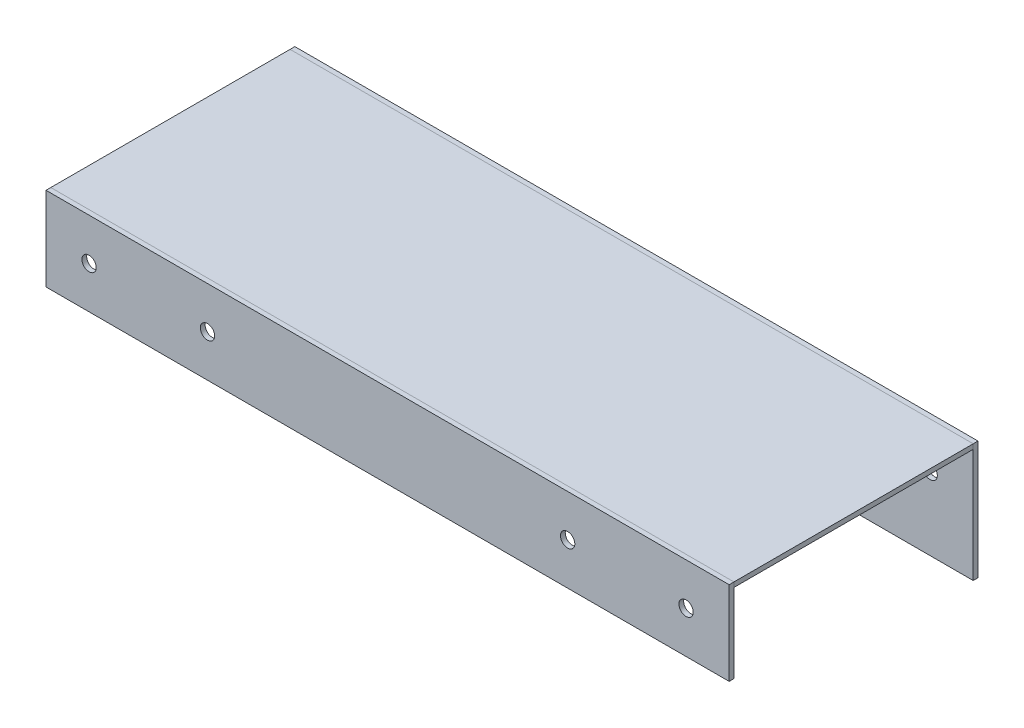
ISO-10303-21;
HEADER;
FILE_DESCRIPTION(('STEP AP214'),'2;1');
FILE_NAME('part.step','',(''),(''),'','','');
FILE_SCHEMA(('AUTOMOTIVE_DESIGN { 1 0 10303 214 1 1 1 1 }'));
ENDSEC;
DATA;
#1=APPLICATION_CONTEXT('core data for automotive mechanical design processes');
#2=APPLICATION_PROTOCOL_DEFINITION('international standard','automotive_design',2000,#1);
#3=PRODUCT_CONTEXT('',#1,'mechanical');
#4=PRODUCT('Part','Part','',(#3));
#5=PRODUCT_RELATED_PRODUCT_CATEGORY('part','',(#4));
#6=PRODUCT_DEFINITION_FORMATION('','',#4);
#7=PRODUCT_DEFINITION_CONTEXT('part definition',#1,'design');
#8=PRODUCT_DEFINITION('design','',#6,#7);
#9=PRODUCT_DEFINITION_SHAPE('','',#8);
#10=(LENGTH_UNIT() NAMED_UNIT(*) SI_UNIT(.MILLI.,.METRE.));
#11=(NAMED_UNIT(*) PLANE_ANGLE_UNIT() SI_UNIT($,.RADIAN.));
#12=(NAMED_UNIT(*) SI_UNIT($,.STERADIAN.) SOLID_ANGLE_UNIT());
#13=UNCERTAINTY_MEASURE_WITH_UNIT(LENGTH_MEASURE(1.E-05),#10,'distance_accuracy_value','');
#14=(GEOMETRIC_REPRESENTATION_CONTEXT(3) GLOBAL_UNCERTAINTY_ASSIGNED_CONTEXT((#13)) GLOBAL_UNIT_ASSIGNED_CONTEXT((#10,
#11,#12)) REPRESENTATION_CONTEXT('',''));
#15=CARTESIAN_POINT('',(0.,0.,0.));
#16=DIRECTION('',(0.,0.,1.));
#17=DIRECTION('',(1.,0.,0.));
#18=AXIS2_PLACEMENT_3D('',#15,#16,#17);
#19=CARTESIAN_POINT('',(-37.505803891122,45.7813109581088,113.428482269106));
#20=DIRECTION('',(0.,0.,1.));
#21=DIRECTION('',(1.,0.,0.));
#22=AXIS2_PLACEMENT_3D('',#19,#20,#21);
#23=PLANE('',#22);
#24=CARTESIAN_POINT('',(37.7441961088779,45.7813109581088,113.428482269106));
#25=DIRECTION('',(0.,0.,1.));
#26=DIRECTION('',(-1.,0.,0.));
#27=AXIS2_PLACEMENT_3D('',#24,#25,#26);
#28=CIRCLE('',#27,3.00000000000001);
#29=CARTESIAN_POINT('',(34.7441961088779,45.7813109581088,113.428482269106));
#30=VERTEX_POINT('',#29);
#31=EDGE_CURVE('P0_E104',#30,#30,#28,.T.);
#32=ORIENTED_EDGE('',*,*,#31,.F.);
#33=EDGE_LOOP('',(#32));
#34=FACE_BOUND('',#33,.T.);
#35=CARTESIAN_POINT('',(-162.255803891122,45.7813109581088,113.428482269106));
#36=DIRECTION('',(0.,0.,1.));
#37=DIRECTION('',(1.,0.,0.));
#38=AXIS2_PLACEMENT_3D('',#35,#36,#37);
#39=CIRCLE('',#38,3.00000000000001);
#40=CARTESIAN_POINT('',(-159.255803891122,45.7813109581088,113.428482269106));
#41=VERTEX_POINT('',#40);
#42=EDGE_CURVE('P0_E83',#41,#41,#39,.T.);
#43=ORIENTED_EDGE('',*,*,#42,.F.);
#44=EDGE_LOOP('',(#43));
#45=FACE_BOUND('',#44,.T.);
#46=DIRECTION('',(0.,1.,0.));
#47=VECTOR('',#46,1.);
#48=CARTESIAN_POINT('',(105.244196108878,63.2813109581088,113.428482269106));
#49=LINE('',#48,#47);
#50=CARTESIAN_POINT('',(105.244196108878,28.2813109581088,113.428482269106));
#51=VERTEX_POINT('',#50);
#52=CARTESIAN_POINT('',(105.244196108878,63.2813109581088,113.428482269106));
#53=VERTEX_POINT('',#52);
#54=EDGE_CURVE('P0_E68',#51,#53,#49,.T.);
#55=ORIENTED_EDGE('',*,*,#54,.T.);
#56=DIRECTION('',(-1.,0.,0.));
#57=VECTOR('',#56,1.);
#58=CARTESIAN_POINT('',(-180.255803891122,63.2813109581088,113.428482269106));
#59=LINE('',#58,#57);
#60=CARTESIAN_POINT('',(-180.255803891122,63.2813109581088,113.428482269106));
#61=VERTEX_POINT('',#60);
#62=EDGE_CURVE('P0_E63',#53,#61,#59,.T.);
#63=ORIENTED_EDGE('',*,*,#62,.T.);
#64=DIRECTION('',(0.,-1.,0.));
#65=VECTOR('',#64,1.);
#66=CARTESIAN_POINT('',(-180.255803891122,63.2813109581088,113.428482269106));
#67=LINE('',#66,#65);
#68=CARTESIAN_POINT('',(-180.255803891122,28.2813109581088,113.428482269106));
#69=VERTEX_POINT('',#68);
#70=EDGE_CURVE('P0_E66',#61,#69,#67,.T.);
#71=ORIENTED_EDGE('',*,*,#70,.T.);
#72=DIRECTION('',(1.,0.,0.));
#73=VECTOR('',#72,1.);
#74=CARTESIAN_POINT('',(-180.255803891122,28.2813109581088,113.428482269106));
#75=LINE('',#74,#73);
#76=EDGE_CURVE('P0_E33',#69,#51,#75,.T.);
#77=ORIENTED_EDGE('',*,*,#76,.T.);
#78=EDGE_LOOP('',(#55,#63,#71,#77));
#79=FACE_BOUND('',#78,.T.);
#80=CARTESIAN_POINT('',(-112.755803891122,45.7813109581088,113.428482269106));
#81=DIRECTION('',(0.,0.,1.));
#82=DIRECTION('',(1.,0.,0.));
#83=AXIS2_PLACEMENT_3D('',#80,#81,#82);
#84=CIRCLE('',#83,3.00000000000001);
#85=CARTESIAN_POINT('',(-109.755803891122,45.7813109581088,113.428482269106));
#86=VERTEX_POINT('',#85);
#87=EDGE_CURVE('P0_E98',#86,#86,#84,.T.);
#88=ORIENTED_EDGE('',*,*,#87,.F.);
#89=EDGE_LOOP('',(#88));
#90=FACE_BOUND('',#89,.T.);
#91=CARTESIAN_POINT('',(87.244196108878,45.7813109581088,113.428482269106));
#92=DIRECTION('',(0.,0.,1.));
#93=DIRECTION('',(-1.,0.,0.));
#94=AXIS2_PLACEMENT_3D('',#91,#92,#93);
#95=CIRCLE('',#94,3.00000000000001);
#96=CARTESIAN_POINT('',(84.244196108878,45.7813109581088,113.428482269106));
#97=VERTEX_POINT('',#96);
#98=EDGE_CURVE('P0_E110',#97,#97,#95,.T.);
#99=ORIENTED_EDGE('',*,*,#98,.F.);
#100=EDGE_LOOP('',(#99));
#101=FACE_BOUND('',#100,.T.);
#102=ADVANCED_FACE('P0_F16',(#34,#45,#79,#90,#101),#23,.T.);
#103=CARTESIAN_POINT('',(-37.505803891122,45.7813109581088,111.428482269106));
#104=DIRECTION('',(0.,0.,1.));
#105=DIRECTION('',(1.,0.,0.));
#106=AXIS2_PLACEMENT_3D('',#103,#104,#105);
#107=PLANE('',#106);
#108=DIRECTION('',(0.,1.,0.));
#109=VECTOR('',#108,1.);
#110=CARTESIAN_POINT('',(105.244196108878,63.2813109581088,111.428482269106));
#111=LINE('',#110,#109);
#112=CARTESIAN_POINT('',(105.244196108878,28.2813109581088,111.428482269106));
#113=VERTEX_POINT('',#112);
#114=CARTESIAN_POINT('',(105.244196108878,63.2813109581088,111.428482269106));
#115=VERTEX_POINT('',#114);
#116=EDGE_CURVE('P0_E80',#113,#115,#111,.T.);
#117=ORIENTED_EDGE('',*,*,#116,.F.);
#118=DIRECTION('',(1.,0.,0.));
#119=VECTOR('',#118,1.);
#120=CARTESIAN_POINT('',(-180.255803891122,28.2813109581088,111.428482269106));
#121=LINE('',#120,#119);
#122=CARTESIAN_POINT('',(-180.255803891122,28.2813109581088,111.428482269106));
#123=VERTEX_POINT('',#122);
#124=EDGE_CURVE('P0_E56',#123,#113,#121,.T.);
#125=ORIENTED_EDGE('',*,*,#124,.F.);
#126=DIRECTION('',(0.,-1.,0.));
#127=VECTOR('',#126,1.);
#128=CARTESIAN_POINT('',(-180.255803891122,63.2813109581088,111.428482269106));
#129=LINE('',#128,#127);
#130=CARTESIAN_POINT('',(-180.255803891122,63.2813109581088,111.428482269106));
#131=VERTEX_POINT('',#130);
#132=EDGE_CURVE('P0_E50',#131,#123,#129,.T.);
#133=ORIENTED_EDGE('',*,*,#132,.F.);
#134=DIRECTION('',(-1.,0.,0.));
#135=VECTOR('',#134,1.);
#136=CARTESIAN_POINT('',(-180.255803891122,63.2813109581088,111.428482269106));
#137=LINE('',#136,#135);
#138=EDGE_CURVE('P0_E72',#115,#131,#137,.T.);
#139=ORIENTED_EDGE('',*,*,#138,.F.);
#140=EDGE_LOOP('',(#117,#125,#133,#139));
#141=FACE_BOUND('',#140,.T.);
#142=CARTESIAN_POINT('',(-162.255803891122,45.7813109581088,111.428482269106));
#143=DIRECTION('',(0.,0.,1.));
#144=DIRECTION('',(1.,0.,0.));
#145=AXIS2_PLACEMENT_3D('',#142,#143,#144);
#146=CIRCLE('',#145,3.00000000000001);
#147=CARTESIAN_POINT('',(-159.255803891122,45.7813109581088,111.428482269106));
#148=VERTEX_POINT('',#147);
#149=EDGE_CURVE('P0_E95',#148,#148,#146,.T.);
#150=ORIENTED_EDGE('',*,*,#149,.T.);
#151=EDGE_LOOP('',(#150));
#152=FACE_BOUND('',#151,.T.);
#153=CARTESIAN_POINT('',(-112.755803891122,45.7813109581088,111.428482269106));
#154=DIRECTION('',(0.,0.,1.));
#155=DIRECTION('',(1.,0.,0.));
#156=AXIS2_PLACEMENT_3D('',#153,#154,#155);
#157=CIRCLE('',#156,3.00000000000001);
#158=CARTESIAN_POINT('',(-109.755803891122,45.7813109581088,111.428482269106));
#159=VERTEX_POINT('',#158);
#160=EDGE_CURVE('P0_E101',#159,#159,#157,.T.);
#161=ORIENTED_EDGE('',*,*,#160,.T.);
#162=EDGE_LOOP('',(#161));
#163=FACE_BOUND('',#162,.T.);
#164=CARTESIAN_POINT('',(37.7441961088779,45.7813109581088,111.428482269106));
#165=DIRECTION('',(0.,0.,1.));
#166=DIRECTION('',(-1.,0.,0.));
#167=AXIS2_PLACEMENT_3D('',#164,#165,#166);
#168=CIRCLE('',#167,3.00000000000001);
#169=CARTESIAN_POINT('',(34.7441961088779,45.7813109581088,111.428482269106));
#170=VERTEX_POINT('',#169);
#171=EDGE_CURVE('P0_E107',#170,#170,#168,.T.);
#172=ORIENTED_EDGE('',*,*,#171,.T.);
#173=EDGE_LOOP('',(#172));
#174=FACE_BOUND('',#173,.T.);
#175=CARTESIAN_POINT('',(87.244196108878,45.7813109581088,111.428482269106));
#176=DIRECTION('',(0.,0.,1.));
#177=DIRECTION('',(-1.,0.,0.));
#178=AXIS2_PLACEMENT_3D('',#175,#176,#177);
#179=CIRCLE('',#178,3.00000000000001);
#180=CARTESIAN_POINT('',(84.244196108878,45.7813109581088,111.428482269106));
#181=VERTEX_POINT('',#180);
#182=EDGE_CURVE('P0_E113',#181,#181,#179,.T.);
#183=ORIENTED_EDGE('',*,*,#182,.T.);
#184=EDGE_LOOP('',(#183));
#185=FACE_BOUND('',#184,.T.);
#186=ADVANCED_FACE('P0_F91',(#141,#152,#163,#174,#185),#107,.F.);
#187=CARTESIAN_POINT('',(105.244196108878,63.2813109581088,113.428482269106));
#188=DIRECTION('',(-1.,0.,0.));
#189=DIRECTION('',(0.,0.,1.));
#190=AXIS2_PLACEMENT_3D('',#187,#188,#189);
#191=PLANE('',#190);
#192=ORIENTED_EDGE('',*,*,#116,.T.);
#193=DIRECTION('',(0.,0.,-1.));
#194=VECTOR('',#193,1.);
#195=CARTESIAN_POINT('',(105.244196108878,63.2813109581088,113.428482269106));
#196=LINE('',#195,#194);
#197=EDGE_CURVE('P0_E10',#53,#115,#196,.T.);
#198=ORIENTED_EDGE('',*,*,#197,.F.);
#199=ORIENTED_EDGE('',*,*,#54,.F.);
#200=DIRECTION('',(0.,0.,-1.));
#201=VECTOR('',#200,1.);
#202=CARTESIAN_POINT('',(105.244196108878,28.2813109581088,113.428482269106));
#203=LINE('',#202,#201);
#204=EDGE_CURVE('P0_E76',#51,#113,#203,.T.);
#205=ORIENTED_EDGE('',*,*,#204,.T.);
#206=EDGE_LOOP('',(#192,#198,#199,#205));
#207=FACE_BOUND('',#206,.T.);
#208=ADVANCED_FACE('P0_F18',(#207),#191,.F.);
#209=CARTESIAN_POINT('',(-180.255803891122,63.2813109581088,113.428482269106));
#210=DIRECTION('',(0.,-1.,0.));
#211=DIRECTION('',(0.,0.,-1.));
#212=AXIS2_PLACEMENT_3D('',#209,#210,#211);
#213=PLANE('',#212);
#214=ORIENTED_EDGE('',*,*,#138,.T.);
#215=DIRECTION('',(0.,0.,-1.));
#216=VECTOR('',#215,1.);
#217=CARTESIAN_POINT('',(-180.255803891122,63.2813109581088,113.428482269106));
#218=LINE('',#217,#216);
#219=EDGE_CURVE('P0_E25',#61,#131,#218,.T.);
#220=ORIENTED_EDGE('',*,*,#219,.F.);
#221=ORIENTED_EDGE('',*,*,#62,.F.);
#222=ORIENTED_EDGE('',*,*,#197,.T.);
#223=EDGE_LOOP('',(#214,#220,#221,#222));
#224=FACE_BOUND('',#223,.T.);
#225=ADVANCED_FACE('P0_F71',(#224),#213,.F.);
#226=CARTESIAN_POINT('',(-180.255803891122,63.2813109581088,113.428482269106));
#227=DIRECTION('',(1.,0.,0.));
#228=DIRECTION('',(0.,0.,-1.));
#229=AXIS2_PLACEMENT_3D('',#226,#227,#228);
#230=PLANE('',#229);
#231=ORIENTED_EDGE('',*,*,#132,.T.);
#232=DIRECTION('',(0.,0.,-1.));
#233=VECTOR('',#232,1.);
#234=CARTESIAN_POINT('',(-180.255803891122,28.2813109581088,113.428482269106));
#235=LINE('',#234,#233);
#236=EDGE_CURVE('P0_E73',#69,#123,#235,.T.);
#237=ORIENTED_EDGE('',*,*,#236,.F.);
#238=ORIENTED_EDGE('',*,*,#70,.F.);
#239=ORIENTED_EDGE('',*,*,#219,.T.);
#240=EDGE_LOOP('',(#231,#237,#238,#239));
#241=FACE_BOUND('',#240,.T.);
#242=ADVANCED_FACE('P0_F74',(#241),#230,.F.);
#243=CARTESIAN_POINT('',(-180.255803891122,28.2813109581088,113.428482269106));
#244=DIRECTION('',(0.,1.,0.));
#245=DIRECTION('',(0.,0.,1.));
#246=AXIS2_PLACEMENT_3D('',#243,#244,#245);
#247=PLANE('',#246);
#248=ORIENTED_EDGE('',*,*,#124,.T.);
#249=ORIENTED_EDGE('',*,*,#204,.F.);
#250=ORIENTED_EDGE('',*,*,#76,.F.);
#251=ORIENTED_EDGE('',*,*,#236,.T.);
#252=EDGE_LOOP('',(#248,#249,#250,#251));
#253=FACE_BOUND('',#252,.T.);
#254=ADVANCED_FACE('P0_F88',(#253),#247,.F.);
#255=CARTESIAN_POINT('',(-162.255803891122,45.7813109581088,113.428482269106));
#256=DIRECTION('',(0.,0.,-1.));
#257=DIRECTION('',(-1.,0.,0.));
#258=AXIS2_PLACEMENT_3D('',#255,#256,#257);
#259=CYLINDRICAL_SURFACE('',#258,3.00000000000001);
#260=ORIENTED_EDGE('',*,*,#42,.T.);
#261=EDGE_LOOP('',(#260));
#262=FACE_BOUND('',#261,.T.);
#263=ORIENTED_EDGE('',*,*,#149,.F.);
#264=EDGE_LOOP('',(#263));
#265=FACE_BOUND('',#264,.T.);
#266=ADVANCED_FACE('P0_F133',(#262,#265),#259,.F.);
#267=CARTESIAN_POINT('',(-112.755803891122,45.7813109581088,113.428482269106));
#268=DIRECTION('',(0.,0.,-1.));
#269=DIRECTION('',(-1.,0.,0.));
#270=AXIS2_PLACEMENT_3D('',#267,#268,#269);
#271=CYLINDRICAL_SURFACE('',#270,3.00000000000001);
#272=ORIENTED_EDGE('',*,*,#87,.T.);
#273=EDGE_LOOP('',(#272));
#274=FACE_BOUND('',#273,.T.);
#275=ORIENTED_EDGE('',*,*,#160,.F.);
#276=EDGE_LOOP('',(#275));
#277=FACE_BOUND('',#276,.T.);
#278=ADVANCED_FACE('P0_F186',(#274,#277),#271,.F.);
#279=CARTESIAN_POINT('',(37.7441961088779,45.7813109581088,113.428482269106));
#280=DIRECTION('',(0.,0.,-1.));
#281=DIRECTION('',(-1.,0.,0.));
#282=AXIS2_PLACEMENT_3D('',#279,#280,#281);
#283=CYLINDRICAL_SURFACE('',#282,3.00000000000001);
#284=ORIENTED_EDGE('',*,*,#31,.T.);
#285=EDGE_LOOP('',(#284));
#286=FACE_BOUND('',#285,.T.);
#287=ORIENTED_EDGE('',*,*,#171,.F.);
#288=EDGE_LOOP('',(#287));
#289=FACE_BOUND('',#288,.T.);
#290=ADVANCED_FACE('P0_F194',(#286,#289),#283,.F.);
#291=CARTESIAN_POINT('',(87.244196108878,45.7813109581088,113.428482269106));
#292=DIRECTION('',(0.,0.,-1.));
#293=DIRECTION('',(-1.,0.,0.));
#294=AXIS2_PLACEMENT_3D('',#291,#292,#293);
#295=CYLINDRICAL_SURFACE('',#294,3.00000000000001);
#296=ORIENTED_EDGE('',*,*,#98,.T.);
#297=EDGE_LOOP('',(#296));
#298=FACE_BOUND('',#297,.T.);
#299=ORIENTED_EDGE('',*,*,#182,.F.);
#300=EDGE_LOOP('',(#299));
#301=FACE_BOUND('',#300,.T.);
#302=ADVANCED_FACE('P0_F119',(#298,#301),#295,.F.);
#303=CLOSED_SHELL('',(#102,#186,#208,#225,#242,#254,#266,#278,#290,#302));
#304=MANIFOLD_SOLID_BREP('P0_B1',#303);
#305=CARTESIAN_POINT('',(105.244196108878,61.2813109581088,111.428482269106));
#306=DIRECTION('',(-1.,0.,0.));
#307=DIRECTION('',(0.,-1.,0.));
#308=AXIS2_PLACEMENT_3D('',#305,#306,#307);
#309=PLANE('',#308);
#310=DIRECTION('',(0.,0.,1.));
#311=VECTOR('',#310,1.);
#312=CARTESIAN_POINT('',(105.244196108878,63.2813109581088,111.428482269106));
#313=LINE('',#312,#311);
#314=CARTESIAN_POINT('',(105.244196108878,63.2813109581088,11.4284822691056));
#315=VERTEX_POINT('',#314);
#316=CARTESIAN_POINT('',(105.244196108878,63.2813109581088,111.428482269106));
#317=VERTEX_POINT('',#316);
#318=EDGE_CURVE('P1_E80',#315,#317,#313,.T.);
#319=ORIENTED_EDGE('',*,*,#318,.T.);
#320=DIRECTION('',(0.,1.,0.));
#321=VECTOR('',#320,1.);
#322=CARTESIAN_POINT('',(105.244196108878,61.2813109581088,111.428482269106));
#323=LINE('',#322,#321);
#324=CARTESIAN_POINT('',(105.244196108878,61.2813109581088,111.428482269106));
#325=VERTEX_POINT('',#324);
#326=EDGE_CURVE('P1_E11',#325,#317,#323,.T.);
#327=ORIENTED_EDGE('',*,*,#326,.F.);
#328=DIRECTION('',(0.,0.,1.));
#329=VECTOR('',#328,1.);
#330=CARTESIAN_POINT('',(105.244196108878,61.2813109581088,111.428482269106));
#331=LINE('',#330,#329);
#332=CARTESIAN_POINT('',(105.244196108878,61.2813109581088,11.4284822691056));
#333=VERTEX_POINT('',#332);
#334=EDGE_CURVE('P1_E68',#333,#325,#331,.T.);
#335=ORIENTED_EDGE('',*,*,#334,.F.);
#336=DIRECTION('',(0.,1.,0.));
#337=VECTOR('',#336,1.);
#338=CARTESIAN_POINT('',(105.244196108878,61.2813109581088,11.4284822691056));
#339=LINE('',#338,#337);
#340=EDGE_CURVE('P1_E76',#333,#315,#339,.T.);
#341=ORIENTED_EDGE('',*,*,#340,.T.);
#342=EDGE_LOOP('',(#319,#327,#335,#341));
#343=FACE_BOUND('',#342,.T.);
#344=ADVANCED_FACE('P1_F17',(#343),#309,.F.);
#345=CARTESIAN_POINT('',(-180.255803891122,61.2813109581088,111.428482269106));
#346=DIRECTION('',(0.,0.,-1.));
#347=DIRECTION('',(0.,1.,0.));
#348=AXIS2_PLACEMENT_3D('',#345,#346,#347);
#349=PLANE('',#348);
#350=DIRECTION('',(-1.,0.,0.));
#351=VECTOR('',#350,1.);
#352=CARTESIAN_POINT('',(-180.255803891122,63.2813109581088,111.428482269106));
#353=LINE('',#352,#351);
#354=CARTESIAN_POINT('',(-180.255803891122,63.2813109581088,111.428482269106));
#355=VERTEX_POINT('',#354);
#356=EDGE_CURVE('P1_E72',#317,#355,#353,.T.);
#357=ORIENTED_EDGE('',*,*,#356,.T.);
#358=DIRECTION('',(0.,1.,0.));
#359=VECTOR('',#358,1.);
#360=CARTESIAN_POINT('',(-180.255803891122,61.2813109581088,111.428482269106));
#361=LINE('',#360,#359);
#362=CARTESIAN_POINT('',(-180.255803891122,61.2813109581088,111.428482269106));
#363=VERTEX_POINT('',#362);
#364=EDGE_CURVE('P1_E25',#363,#355,#361,.T.);
#365=ORIENTED_EDGE('',*,*,#364,.F.);
#366=DIRECTION('',(-1.,0.,0.));
#367=VECTOR('',#366,1.);
#368=CARTESIAN_POINT('',(-180.255803891122,61.2813109581088,111.428482269106));
#369=LINE('',#368,#367);
#370=EDGE_CURVE('P1_E63',#325,#363,#369,.T.);
#371=ORIENTED_EDGE('',*,*,#370,.F.);
#372=ORIENTED_EDGE('',*,*,#326,.T.);
#373=EDGE_LOOP('',(#357,#365,#371,#372));
#374=FACE_BOUND('',#373,.T.);
#375=ADVANCED_FACE('P1_F71',(#374),#349,.F.);
#376=CARTESIAN_POINT('',(-180.255803891122,61.2813109581088,111.428482269106));
#377=DIRECTION('',(1.,0.,0.));
#378=DIRECTION('',(0.,1.,0.));
#379=AXIS2_PLACEMENT_3D('',#376,#377,#378);
#380=PLANE('',#379);
#381=DIRECTION('',(0.,0.,-1.));
#382=VECTOR('',#381,1.);
#383=CARTESIAN_POINT('',(-180.255803891122,63.2813109581088,111.428482269106));
#384=LINE('',#383,#382);
#385=CARTESIAN_POINT('',(-180.255803891122,63.2813109581088,11.4284822691056));
#386=VERTEX_POINT('',#385);
#387=EDGE_CURVE('P1_E50',#355,#386,#384,.T.);
#388=ORIENTED_EDGE('',*,*,#387,.T.);
#389=DIRECTION('',(0.,1.,0.));
#390=VECTOR('',#389,1.);
#391=CARTESIAN_POINT('',(-180.255803891122,61.2813109581088,11.4284822691056));
#392=LINE('',#391,#390);
#393=CARTESIAN_POINT('',(-180.255803891122,61.2813109581088,11.4284822691056));
#394=VERTEX_POINT('',#393);
#395=EDGE_CURVE('P1_E73',#394,#386,#392,.T.);
#396=ORIENTED_EDGE('',*,*,#395,.F.);
#397=DIRECTION('',(0.,0.,-1.));
#398=VECTOR('',#397,1.);
#399=CARTESIAN_POINT('',(-180.255803891122,61.2813109581088,111.428482269106));
#400=LINE('',#399,#398);
#401=EDGE_CURVE('P1_E66',#363,#394,#400,.T.);
#402=ORIENTED_EDGE('',*,*,#401,.F.);
#403=ORIENTED_EDGE('',*,*,#364,.T.);
#404=EDGE_LOOP('',(#388,#396,#402,#403));
#405=FACE_BOUND('',#404,.T.);
#406=ADVANCED_FACE('P1_F74',(#405),#380,.F.);
#407=CARTESIAN_POINT('',(-180.255803891122,61.2813109581088,11.4284822691056));
#408=DIRECTION('',(0.,0.,1.));
#409=DIRECTION('',(0.,-1.,0.));
#410=AXIS2_PLACEMENT_3D('',#407,#408,#409);
#411=PLANE('',#410);
#412=DIRECTION('',(1.,0.,0.));
#413=VECTOR('',#412,1.);
#414=CARTESIAN_POINT('',(-180.255803891122,63.2813109581088,11.4284822691056));
#415=LINE('',#414,#413);
#416=EDGE_CURVE('P1_E56',#386,#315,#415,.T.);
#417=ORIENTED_EDGE('',*,*,#416,.T.);
#418=ORIENTED_EDGE('',*,*,#340,.F.);
#419=DIRECTION('',(1.,0.,0.));
#420=VECTOR('',#419,1.);
#421=CARTESIAN_POINT('',(-180.255803891122,61.2813109581088,11.4284822691056));
#422=LINE('',#421,#420);
#423=EDGE_CURVE('P1_E33',#394,#333,#422,.T.);
#424=ORIENTED_EDGE('',*,*,#423,.F.);
#425=ORIENTED_EDGE('',*,*,#395,.T.);
#426=EDGE_LOOP('',(#417,#418,#424,#425));
#427=FACE_BOUND('',#426,.T.);
#428=ADVANCED_FACE('P1_F87',(#427),#411,.F.);
#429=CARTESIAN_POINT('',(-37.505803891122,61.2813109581088,61.4284822691057));
#430=DIRECTION('',(0.,-1.,0.));
#431=DIRECTION('',(1.,0.,0.));
#432=AXIS2_PLACEMENT_3D('',#429,#430,#431);
#433=PLANE('',#432);
#434=ORIENTED_EDGE('',*,*,#334,.T.);
#435=ORIENTED_EDGE('',*,*,#370,.T.);
#436=ORIENTED_EDGE('',*,*,#401,.T.);
#437=ORIENTED_EDGE('',*,*,#423,.T.);
#438=EDGE_LOOP('',(#434,#435,#436,#437));
#439=FACE_BOUND('',#438,.T.);
#440=ADVANCED_FACE('P1_F64',(#439),#433,.T.);
#441=CARTESIAN_POINT('',(-37.505803891122,63.2813109581088,61.4284822691057));
#442=DIRECTION('',(0.,-1.,0.));
#443=DIRECTION('',(1.,0.,0.));
#444=AXIS2_PLACEMENT_3D('',#441,#442,#443);
#445=PLANE('',#444);
#446=ORIENTED_EDGE('',*,*,#318,.F.);
#447=ORIENTED_EDGE('',*,*,#416,.F.);
#448=ORIENTED_EDGE('',*,*,#387,.F.);
#449=ORIENTED_EDGE('',*,*,#356,.F.);
#450=EDGE_LOOP('',(#446,#447,#448,#449));
#451=FACE_BOUND('',#450,.T.);
#452=ADVANCED_FACE('P1_F90',(#451),#445,.F.);
#453=CLOSED_SHELL('',(#344,#375,#406,#428,#440,#452));
#454=MANIFOLD_SOLID_BREP('P1_B1',#453);
#455=CARTESIAN_POINT('',(-37.505803891122,13.7813109581089,11.4284822691056));
#456=DIRECTION('',(0.,0.,-1.));
#457=DIRECTION('',(-1.,0.,0.));
#458=AXIS2_PLACEMENT_3D('',#455,#456,#457);
#459=PLANE('',#458);
#460=DIRECTION('',(-1.,0.,0.));
#461=VECTOR('',#460,1.);
#462=CARTESIAN_POINT('',(-180.255803891122,63.2813109581089,11.4284822691056));
#463=LINE('',#462,#461);
#464=CARTESIAN_POINT('',(105.244196108878,63.2813109581088,11.4284822691056));
#465=VERTEX_POINT('',#464);
#466=CARTESIAN_POINT('',(-180.255803891122,63.2813109581089,11.4284822691056));
#467=VERTEX_POINT('',#466);
#468=EDGE_CURVE('P2_E67',#465,#467,#463,.T.);
#469=ORIENTED_EDGE('',*,*,#468,.T.);
#470=DIRECTION('',(0.,-1.,0.));
#471=VECTOR('',#470,1.);
#472=CARTESIAN_POINT('',(-180.255803891122,63.2813109581089,11.4284822691056));
#473=LINE('',#472,#471);
#474=CARTESIAN_POINT('',(-180.255803891122,13.7813109581089,11.4284822691056));
#475=VERTEX_POINT('',#474);
#476=EDGE_CURVE('P2_E62',#467,#475,#473,.T.);
#477=ORIENTED_EDGE('',*,*,#476,.T.);
#478=DIRECTION('',(1.,0.,0.));
#479=VECTOR('',#478,1.);
#480=CARTESIAN_POINT('',(-180.255803891122,13.7813109581089,11.4284822691056));
#481=LINE('',#480,#479);
#482=CARTESIAN_POINT('',(105.244196108878,13.7813109581089,11.4284822691056));
#483=VERTEX_POINT('',#482);
#484=EDGE_CURVE('P2_E65',#475,#483,#481,.T.);
#485=ORIENTED_EDGE('',*,*,#484,.T.);
#486=DIRECTION('',(0.,1.,0.));
#487=VECTOR('',#486,1.);
#488=CARTESIAN_POINT('',(105.244196108878,63.2813109581088,11.4284822691056));
#489=LINE('',#488,#487);
#490=EDGE_CURVE('P2_E33',#483,#465,#489,.T.);
#491=ORIENTED_EDGE('',*,*,#490,.T.);
#492=EDGE_LOOP('',(#469,#477,#485,#491));
#493=FACE_BOUND('',#492,.T.);
#494=CARTESIAN_POINT('',(87.244196108878,44.2813109581089,11.4284822691056));
#495=DIRECTION('',(0.,0.,1.));
#496=DIRECTION('',(1.,0.,0.));
#497=AXIS2_PLACEMENT_3D('',#494,#495,#496);
#498=CIRCLE('',#497,2.99999999999998);
#499=CARTESIAN_POINT('',(90.244196108878,44.2813109581089,11.4284822691056));
#500=VERTEX_POINT('',#499);
#501=EDGE_CURVE('P2_E83',#500,#500,#498,.T.);
#502=ORIENTED_EDGE('',*,*,#501,.F.);
#503=EDGE_LOOP('',(#502));
#504=FACE_BOUND('',#503,.T.);
#505=CARTESIAN_POINT('',(-112.755803891122,44.2813109581089,11.4284822691056));
#506=DIRECTION('',(0.,0.,1.));
#507=DIRECTION('',(1.,0.,0.));
#508=AXIS2_PLACEMENT_3D('',#505,#506,#507);
#509=CIRCLE('',#508,2.99999999999999);
#510=CARTESIAN_POINT('',(-109.755803891122,44.2813109581089,11.4284822691056));
#511=VERTEX_POINT('',#510);
#512=EDGE_CURVE('P2_E98',#511,#511,#509,.T.);
#513=ORIENTED_EDGE('',*,*,#512,.F.);
#514=EDGE_LOOP('',(#513));
#515=FACE_BOUND('',#514,.T.);
#516=CARTESIAN_POINT('',(37.744196108878,44.2813109581089,11.4284822691056));
#517=DIRECTION('',(0.,0.,1.));
#518=DIRECTION('',(-1.,0.,0.));
#519=AXIS2_PLACEMENT_3D('',#516,#517,#518);
#520=CIRCLE('',#519,2.99999999999999);
#521=CARTESIAN_POINT('',(34.744196108878,44.2813109581089,11.4284822691056));
#522=VERTEX_POINT('',#521);
#523=EDGE_CURVE('P2_E104',#522,#522,#520,.T.);
#524=ORIENTED_EDGE('',*,*,#523,.F.);
#525=EDGE_LOOP('',(#524));
#526=FACE_BOUND('',#525,.T.);
#527=CARTESIAN_POINT('',(-162.255803891122,44.2813109581089,11.4284822691056));
#528=DIRECTION('',(0.,0.,1.));
#529=DIRECTION('',(-1.,0.,0.));
#530=AXIS2_PLACEMENT_3D('',#527,#528,#529);
#531=CIRCLE('',#530,2.99999999999998);
#532=CARTESIAN_POINT('',(-165.255803891122,44.2813109581089,11.4284822691056));
#533=VERTEX_POINT('',#532);
#534=EDGE_CURVE('P2_E110',#533,#533,#531,.T.);
#535=ORIENTED_EDGE('',*,*,#534,.F.);
#536=EDGE_LOOP('',(#535));
#537=FACE_BOUND('',#536,.T.);
#538=ADVANCED_FACE('P2_F16',(#493,#504,#515,#526,#537),#459,.F.);
#539=CARTESIAN_POINT('',(-37.505803891122,13.7813109581089,9.42848226910564));
#540=DIRECTION('',(0.,0.,-1.));
#541=DIRECTION('',(-1.,0.,0.));
#542=AXIS2_PLACEMENT_3D('',#539,#540,#541);
#543=PLANE('',#542);
#544=CARTESIAN_POINT('',(37.744196108878,44.2813109581089,9.42848226910564));
#545=DIRECTION('',(0.,0.,1.));
#546=DIRECTION('',(-1.,0.,0.));
#547=AXIS2_PLACEMENT_3D('',#544,#545,#546);
#548=CIRCLE('',#547,2.99999999999999);
#549=CARTESIAN_POINT('',(34.744196108878,44.2813109581089,9.42848226910564));
#550=VERTEX_POINT('',#549);
#551=EDGE_CURVE('P2_E107',#550,#550,#548,.T.);
#552=ORIENTED_EDGE('',*,*,#551,.T.);
#553=EDGE_LOOP('',(#552));
#554=FACE_BOUND('',#553,.T.);
#555=CARTESIAN_POINT('',(87.244196108878,44.2813109581089,9.42848226910564));
#556=DIRECTION('',(0.,0.,1.));
#557=DIRECTION('',(1.,0.,0.));
#558=AXIS2_PLACEMENT_3D('',#555,#556,#557);
#559=CIRCLE('',#558,2.99999999999998);
#560=CARTESIAN_POINT('',(90.244196108878,44.2813109581089,9.42848226910564));
#561=VERTEX_POINT('',#560);
#562=EDGE_CURVE('P2_E95',#561,#561,#559,.T.);
#563=ORIENTED_EDGE('',*,*,#562,.T.);
#564=EDGE_LOOP('',(#563));
#565=FACE_BOUND('',#564,.T.);
#566=DIRECTION('',(-1.,0.,0.));
#567=VECTOR('',#566,1.);
#568=CARTESIAN_POINT('',(-180.255803891122,63.2813109581089,9.42848226910564));
#569=LINE('',#568,#567);
#570=CARTESIAN_POINT('',(105.244196108878,63.2813109581088,9.42848226910564));
#571=VERTEX_POINT('',#570);
#572=CARTESIAN_POINT('',(-180.255803891122,63.2813109581089,9.42848226910564));
#573=VERTEX_POINT('',#572);
#574=EDGE_CURVE('P2_E80',#571,#573,#569,.T.);
#575=ORIENTED_EDGE('',*,*,#574,.F.);
#576=DIRECTION('',(0.,1.,0.));
#577=VECTOR('',#576,1.);
#578=CARTESIAN_POINT('',(105.244196108878,63.2813109581088,9.42848226910564));
#579=LINE('',#578,#577);
#580=CARTESIAN_POINT('',(105.244196108878,13.7813109581089,9.42848226910564));
#581=VERTEX_POINT('',#580);
#582=EDGE_CURVE('P2_E55',#581,#571,#579,.T.);
#583=ORIENTED_EDGE('',*,*,#582,.F.);
#584=DIRECTION('',(1.,0.,0.));
#585=VECTOR('',#584,1.);
#586=CARTESIAN_POINT('',(105.244196108878,13.7813109581089,9.42848226910564));
#587=LINE('',#586,#585);
#588=CARTESIAN_POINT('',(-180.255803891122,13.7813109581089,9.42848226910564));
#589=VERTEX_POINT('',#588);
#590=EDGE_CURVE('P2_E49',#589,#581,#587,.T.);
#591=ORIENTED_EDGE('',*,*,#590,.F.);
#592=DIRECTION('',(0.,-1.,0.));
#593=VECTOR('',#592,1.);
#594=CARTESIAN_POINT('',(-180.255803891122,63.2813109581089,9.42848226910564));
#595=LINE('',#594,#593);
#596=EDGE_CURVE('P2_E72',#573,#589,#595,.T.);
#597=ORIENTED_EDGE('',*,*,#596,.F.);
#598=EDGE_LOOP('',(#575,#583,#591,#597));
#599=FACE_BOUND('',#598,.T.);
#600=CARTESIAN_POINT('',(-112.755803891122,44.2813109581089,9.42848226910564));
#601=DIRECTION('',(0.,0.,1.));
#602=DIRECTION('',(1.,0.,0.));
#603=AXIS2_PLACEMENT_3D('',#600,#601,#602);
#604=CIRCLE('',#603,2.99999999999999);
#605=CARTESIAN_POINT('',(-109.755803891122,44.2813109581089,9.42848226910564));
#606=VERTEX_POINT('',#605);
#607=EDGE_CURVE('P2_E101',#606,#606,#604,.T.);
#608=ORIENTED_EDGE('',*,*,#607,.T.);
#609=EDGE_LOOP('',(#608));
#610=FACE_BOUND('',#609,.T.);
#611=CARTESIAN_POINT('',(-162.255803891122,44.2813109581089,9.42848226910564));
#612=DIRECTION('',(0.,0.,1.));
#613=DIRECTION('',(-1.,0.,0.));
#614=AXIS2_PLACEMENT_3D('',#611,#612,#613);
#615=CIRCLE('',#614,2.99999999999998);
#616=CARTESIAN_POINT('',(-165.255803891122,44.2813109581089,9.42848226910564));
#617=VERTEX_POINT('',#616);
#618=EDGE_CURVE('P2_E113',#617,#617,#615,.T.);
#619=ORIENTED_EDGE('',*,*,#618,.T.);
#620=EDGE_LOOP('',(#619));
#621=FACE_BOUND('',#620,.T.);
#622=ADVANCED_FACE('P2_F91',(#554,#565,#599,#610,#621),#543,.T.);
#623=CARTESIAN_POINT('',(-180.255803891122,63.2813109581089,11.4284822691056));
#624=DIRECTION('',(0.,-1.,0.));
#625=DIRECTION('',(1.,0.,0.));
#626=AXIS2_PLACEMENT_3D('',#623,#624,#625);
#627=PLANE('',#626);
#628=ORIENTED_EDGE('',*,*,#574,.T.);
#629=DIRECTION('',(0.,0.,-1.));
#630=VECTOR('',#629,1.);
#631=CARTESIAN_POINT('',(-180.255803891122,63.2813109581089,11.4284822691056));
#632=LINE('',#631,#630);
#633=EDGE_CURVE('P2_E10',#467,#573,#632,.T.);
#634=ORIENTED_EDGE('',*,*,#633,.F.);
#635=ORIENTED_EDGE('',*,*,#468,.F.);
#636=DIRECTION('',(0.,0.,-1.));
#637=VECTOR('',#636,1.);
#638=CARTESIAN_POINT('',(105.244196108878,63.2813109581088,11.4284822691056));
#639=LINE('',#638,#637);
#640=EDGE_CURVE('P2_E76',#465,#571,#639,.T.);
#641=ORIENTED_EDGE('',*,*,#640,.T.);
#642=EDGE_LOOP('',(#628,#634,#635,#641));
#643=FACE_BOUND('',#642,.T.);
#644=ADVANCED_FACE('P2_F18',(#643),#627,.F.);
#645=CARTESIAN_POINT('',(-180.255803891122,63.2813109581089,11.4284822691056));
#646=DIRECTION('',(1.,0.,0.));
#647=DIRECTION('',(0.,0.,-1.));
#648=AXIS2_PLACEMENT_3D('',#645,#646,#647);
#649=PLANE('',#648);
#650=ORIENTED_EDGE('',*,*,#596,.T.);
#651=DIRECTION('',(0.,0.,-1.));
#652=VECTOR('',#651,1.);
#653=CARTESIAN_POINT('',(-180.255803891122,13.7813109581089,11.4284822691056));
#654=LINE('',#653,#652);
#655=EDGE_CURVE('P2_E25',#475,#589,#654,.T.);
#656=ORIENTED_EDGE('',*,*,#655,.F.);
#657=ORIENTED_EDGE('',*,*,#476,.F.);
#658=ORIENTED_EDGE('',*,*,#633,.T.);
#659=EDGE_LOOP('',(#650,#656,#657,#658));
#660=FACE_BOUND('',#659,.T.);
#661=ADVANCED_FACE('P2_F71',(#660),#649,.F.);
#662=CARTESIAN_POINT('',(105.244196108878,13.7813109581089,11.4284822691056));
#663=DIRECTION('',(0.,1.,0.));
#664=DIRECTION('',(-1.,0.,0.));
#665=AXIS2_PLACEMENT_3D('',#662,#663,#664);
#666=PLANE('',#665);
#667=ORIENTED_EDGE('',*,*,#590,.T.);
#668=DIRECTION('',(0.,0.,-1.));
#669=VECTOR('',#668,1.);
#670=CARTESIAN_POINT('',(105.244196108878,13.7813109581089,11.4284822691056));
#671=LINE('',#670,#669);
#672=EDGE_CURVE('P2_E73',#483,#581,#671,.T.);
#673=ORIENTED_EDGE('',*,*,#672,.F.);
#674=ORIENTED_EDGE('',*,*,#484,.F.);
#675=ORIENTED_EDGE('',*,*,#655,.T.);
#676=EDGE_LOOP('',(#667,#673,#674,#675));
#677=FACE_BOUND('',#676,.T.);
#678=ADVANCED_FACE('P2_F74',(#677),#666,.F.);
#679=CARTESIAN_POINT('',(105.244196108878,63.2813109581088,11.4284822691056));
#680=DIRECTION('',(-1.,0.,0.));
#681=DIRECTION('',(0.,0.,1.));
#682=AXIS2_PLACEMENT_3D('',#679,#680,#681);
#683=PLANE('',#682);
#684=ORIENTED_EDGE('',*,*,#582,.T.);
#685=ORIENTED_EDGE('',*,*,#640,.F.);
#686=ORIENTED_EDGE('',*,*,#490,.F.);
#687=ORIENTED_EDGE('',*,*,#672,.T.);
#688=EDGE_LOOP('',(#684,#685,#686,#687));
#689=FACE_BOUND('',#688,.T.);
#690=ADVANCED_FACE('P2_F88',(#689),#683,.F.);
#691=CARTESIAN_POINT('',(87.244196108878,44.2813109581089,11.4284822691056));
#692=DIRECTION('',(0.,0.,-1.));
#693=DIRECTION('',(-1.,0.,0.));
#694=AXIS2_PLACEMENT_3D('',#691,#692,#693);
#695=CYLINDRICAL_SURFACE('',#694,2.99999999999998);
#696=ORIENTED_EDGE('',*,*,#501,.T.);
#697=EDGE_LOOP('',(#696));
#698=FACE_BOUND('',#697,.T.);
#699=ORIENTED_EDGE('',*,*,#562,.F.);
#700=EDGE_LOOP('',(#699));
#701=FACE_BOUND('',#700,.T.);
#702=ADVANCED_FACE('P2_F131',(#698,#701),#695,.F.);
#703=CARTESIAN_POINT('',(-112.755803891122,44.2813109581089,11.4284822691056));
#704=DIRECTION('',(0.,0.,-1.));
#705=DIRECTION('',(-1.,0.,0.));
#706=AXIS2_PLACEMENT_3D('',#703,#704,#705);
#707=CYLINDRICAL_SURFACE('',#706,2.99999999999999);
#708=ORIENTED_EDGE('',*,*,#512,.T.);
#709=EDGE_LOOP('',(#708));
#710=FACE_BOUND('',#709,.T.);
#711=ORIENTED_EDGE('',*,*,#607,.F.);
#712=EDGE_LOOP('',(#711));
#713=FACE_BOUND('',#712,.T.);
#714=ADVANCED_FACE('P2_F184',(#710,#713),#707,.F.);
#715=CARTESIAN_POINT('',(37.744196108878,44.2813109581089,11.4284822691056));
#716=DIRECTION('',(0.,0.,-1.));
#717=DIRECTION('',(-1.,0.,0.));
#718=AXIS2_PLACEMENT_3D('',#715,#716,#717);
#719=CYLINDRICAL_SURFACE('',#718,2.99999999999999);
#720=ORIENTED_EDGE('',*,*,#523,.T.);
#721=EDGE_LOOP('',(#720));
#722=FACE_BOUND('',#721,.T.);
#723=ORIENTED_EDGE('',*,*,#551,.F.);
#724=EDGE_LOOP('',(#723));
#725=FACE_BOUND('',#724,.T.);
#726=ADVANCED_FACE('P2_F192',(#722,#725),#719,.F.);
#727=CARTESIAN_POINT('',(-162.255803891122,44.2813109581089,11.4284822691056));
#728=DIRECTION('',(0.,0.,-1.));
#729=DIRECTION('',(-1.,0.,0.));
#730=AXIS2_PLACEMENT_3D('',#727,#728,#729);
#731=CYLINDRICAL_SURFACE('',#730,2.99999999999998);
#732=ORIENTED_EDGE('',*,*,#534,.T.);
#733=EDGE_LOOP('',(#732));
#734=FACE_BOUND('',#733,.T.);
#735=ORIENTED_EDGE('',*,*,#618,.F.);
#736=EDGE_LOOP('',(#735));
#737=FACE_BOUND('',#736,.T.);
#738=ADVANCED_FACE('P2_F119',(#734,#737),#731,.F.);
#739=CLOSED_SHELL('',(#538,#622,#644,#661,#678,#690,#702,#714,#726,#738));
#740=MANIFOLD_SOLID_BREP('P2_B1',#739);
#741=ADVANCED_BREP_SHAPE_REPRESENTATION('',(#18,#304,#454,#740),#14);
#742=SHAPE_DEFINITION_REPRESENTATION(#9,#741);
ENDSEC;
END-ISO-10303-21;
